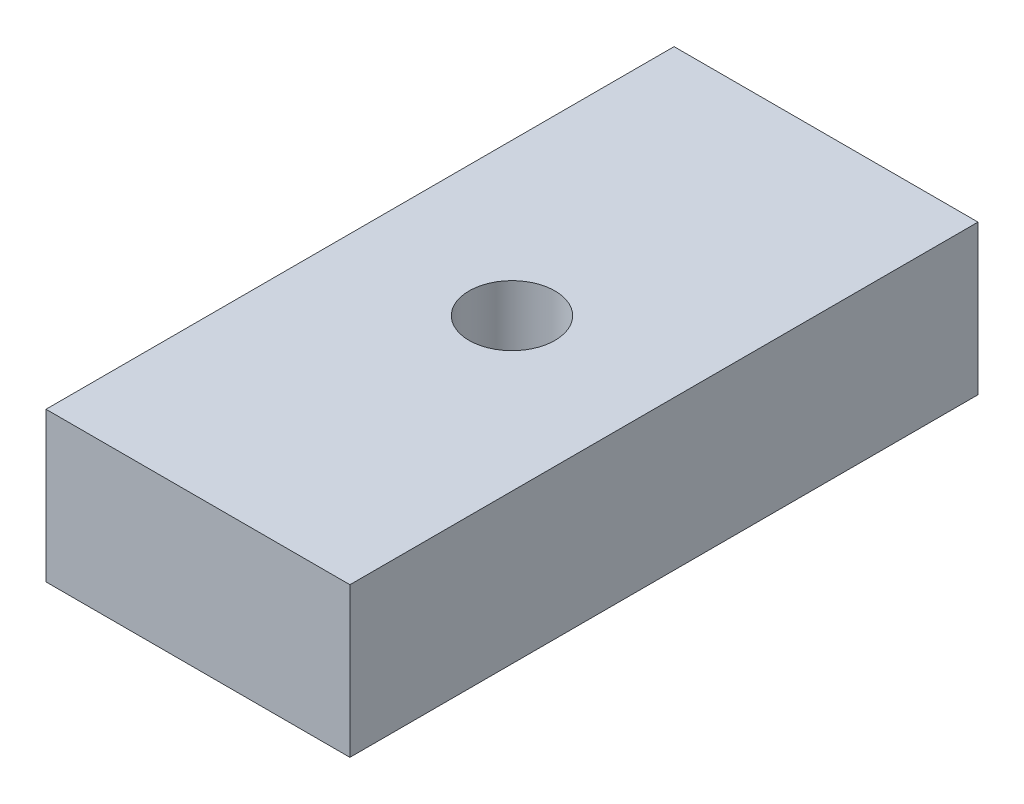
ISO-10303-21;
HEADER;
FILE_DESCRIPTION(('STEP AP214'),'2;1');
FILE_NAME('part.step','',(''),(''),'','','');
FILE_SCHEMA(('AUTOMOTIVE_DESIGN { 1 0 10303 214 1 1 1 1 }'));
ENDSEC;
DATA;
#1=APPLICATION_CONTEXT('core data for automotive mechanical design processes');
#2=APPLICATION_PROTOCOL_DEFINITION('international standard','automotive_design',2000,#1);
#3=PRODUCT_CONTEXT('',#1,'mechanical');
#4=PRODUCT('Part','Part','',(#3));
#5=PRODUCT_RELATED_PRODUCT_CATEGORY('part','',(#4));
#6=PRODUCT_DEFINITION_FORMATION('','',#4);
#7=PRODUCT_DEFINITION_CONTEXT('part definition',#1,'design');
#8=PRODUCT_DEFINITION('design','',#6,#7);
#9=PRODUCT_DEFINITION_SHAPE('','',#8);
#10=(LENGTH_UNIT() NAMED_UNIT(*) SI_UNIT(.MILLI.,.METRE.));
#11=(NAMED_UNIT(*) PLANE_ANGLE_UNIT() SI_UNIT($,.RADIAN.));
#12=(NAMED_UNIT(*) SI_UNIT($,.STERADIAN.) SOLID_ANGLE_UNIT());
#13=UNCERTAINTY_MEASURE_WITH_UNIT(LENGTH_MEASURE(1.E-05),#10,'distance_accuracy_value','');
#14=(GEOMETRIC_REPRESENTATION_CONTEXT(3) GLOBAL_UNCERTAINTY_ASSIGNED_CONTEXT((#13)) GLOBAL_UNIT_ASSIGNED_CONTEXT((#10,
#11,#12)) REPRESENTATION_CONTEXT('',''));
#15=CARTESIAN_POINT('',(0.,0.,0.));
#16=DIRECTION('',(0.,0.,1.));
#17=DIRECTION('',(1.,0.,0.));
#18=AXIS2_PLACEMENT_3D('',#15,#16,#17);
#19=CARTESIAN_POINT('',(4.0005,3.937,8.2677));
#20=DIRECTION('',(-1.,0.,0.));
#21=DIRECTION('',(0.,0.,1.));
#22=AXIS2_PLACEMENT_3D('',#19,#20,#21);
#23=PLANE('',#22);
#24=DIRECTION('',(0.,0.,-1.));
#25=VECTOR('',#24,1.);
#26=CARTESIAN_POINT('',(4.0005,0.,8.2677));
#27=LINE('',#26,#25);
#28=CARTESIAN_POINT('',(4.0005,0.,8.2677));
#29=VERTEX_POINT('',#28);
#30=CARTESIAN_POINT('',(4.0005,0.,-8.2677));
#31=VERTEX_POINT('',#30);
#32=EDGE_CURVE('E105',#29,#31,#27,.T.);
#33=ORIENTED_EDGE('',*,*,#32,.T.);
#34=DIRECTION('',(0.,-1.,0.));
#35=VECTOR('',#34,1.);
#36=CARTESIAN_POINT('',(4.0005,3.937,-8.2677));
#37=LINE('',#36,#35);
#38=CARTESIAN_POINT('',(4.0005,3.937,-8.2677));
#39=VERTEX_POINT('',#38);
#40=EDGE_CURVE('E11',#39,#31,#37,.T.);
#41=ORIENTED_EDGE('',*,*,#40,.F.);
#42=DIRECTION('',(0.,0.,-1.));
#43=VECTOR('',#42,1.);
#44=CARTESIAN_POINT('',(4.0005,3.937,8.2677));
#45=LINE('',#44,#43);
#46=CARTESIAN_POINT('',(4.0005,3.937,8.2677));
#47=VERTEX_POINT('',#46);
#48=EDGE_CURVE('E93',#47,#39,#45,.T.);
#49=ORIENTED_EDGE('',*,*,#48,.F.);
#50=DIRECTION('',(0.,-1.,0.));
#51=VECTOR('',#50,1.);
#52=CARTESIAN_POINT('',(4.0005,3.937,8.2677));
#53=LINE('',#52,#51);
#54=EDGE_CURVE('E101',#47,#29,#53,.T.);
#55=ORIENTED_EDGE('',*,*,#54,.T.);
#56=EDGE_LOOP('',(#33,#41,#49,#55));
#57=FACE_BOUND('',#56,.T.);
#58=ADVANCED_FACE('F42',(#57),#23,.F.);
#59=CARTESIAN_POINT('',(-4.0005,3.937,-8.2677));
#60=DIRECTION('',(0.,0.,1.));
#61=DIRECTION('',(1.,0.,0.));
#62=AXIS2_PLACEMENT_3D('',#59,#60,#61);
#63=PLANE('',#62);
#64=DIRECTION('',(-1.,0.,0.));
#65=VECTOR('',#64,1.);
#66=CARTESIAN_POINT('',(-4.0005,0.,-8.2677));
#67=LINE('',#66,#65);
#68=CARTESIAN_POINT('',(-4.0005,0.,-8.2677));
#69=VERTEX_POINT('',#68);
#70=EDGE_CURVE('E97',#31,#69,#67,.T.);
#71=ORIENTED_EDGE('',*,*,#70,.T.);
#72=DIRECTION('',(0.,-1.,0.));
#73=VECTOR('',#72,1.);
#74=CARTESIAN_POINT('',(-4.0005,3.937,-8.2677));
#75=LINE('',#74,#73);
#76=CARTESIAN_POINT('',(-4.0005,3.937,-8.2677));
#77=VERTEX_POINT('',#76);
#78=EDGE_CURVE('E50',#77,#69,#75,.T.);
#79=ORIENTED_EDGE('',*,*,#78,.F.);
#80=DIRECTION('',(-1.,0.,0.));
#81=VECTOR('',#80,1.);
#82=CARTESIAN_POINT('',(-4.0005,3.937,-8.2677));
#83=LINE('',#82,#81);
#84=EDGE_CURVE('E88',#39,#77,#83,.T.);
#85=ORIENTED_EDGE('',*,*,#84,.F.);
#86=ORIENTED_EDGE('',*,*,#40,.T.);
#87=EDGE_LOOP('',(#71,#79,#85,#86));
#88=FACE_BOUND('',#87,.T.);
#89=ADVANCED_FACE('F96',(#88),#63,.F.);
#90=CARTESIAN_POINT('',(-4.0005,3.937,8.2677));
#91=DIRECTION('',(1.,0.,0.));
#92=DIRECTION('',(0.,0.,-1.));
#93=AXIS2_PLACEMENT_3D('',#90,#91,#92);
#94=PLANE('',#93);
#95=DIRECTION('',(0.,0.,1.));
#96=VECTOR('',#95,1.);
#97=CARTESIAN_POINT('',(-4.0005,0.,8.2677));
#98=LINE('',#97,#96);
#99=CARTESIAN_POINT('',(-4.0005,0.,8.2677));
#100=VERTEX_POINT('',#99);
#101=EDGE_CURVE('E75',#69,#100,#98,.T.);
#102=ORIENTED_EDGE('',*,*,#101,.T.);
#103=DIRECTION('',(0.,-1.,0.));
#104=VECTOR('',#103,1.);
#105=CARTESIAN_POINT('',(-4.0005,3.937,8.2677));
#106=LINE('',#105,#104);
#107=CARTESIAN_POINT('',(-4.0005,3.937,8.2677));
#108=VERTEX_POINT('',#107);
#109=EDGE_CURVE('E98',#108,#100,#106,.T.);
#110=ORIENTED_EDGE('',*,*,#109,.F.);
#111=DIRECTION('',(0.,0.,1.));
#112=VECTOR('',#111,1.);
#113=CARTESIAN_POINT('',(-4.0005,3.937,8.2677));
#114=LINE('',#113,#112);
#115=EDGE_CURVE('E91',#77,#108,#114,.T.);
#116=ORIENTED_EDGE('',*,*,#115,.F.);
#117=ORIENTED_EDGE('',*,*,#78,.T.);
#118=EDGE_LOOP('',(#102,#110,#116,#117));
#119=FACE_BOUND('',#118,.T.);
#120=ADVANCED_FACE('F99',(#119),#94,.F.);
#121=CARTESIAN_POINT('',(-4.0005,3.937,8.2677));
#122=DIRECTION('',(0.,0.,-1.));
#123=DIRECTION('',(-1.,0.,0.));
#124=AXIS2_PLACEMENT_3D('',#121,#122,#123);
#125=PLANE('',#124);
#126=DIRECTION('',(1.,0.,0.));
#127=VECTOR('',#126,1.);
#128=CARTESIAN_POINT('',(-4.0005,0.,8.2677));
#129=LINE('',#128,#127);
#130=EDGE_CURVE('E81',#100,#29,#129,.T.);
#131=ORIENTED_EDGE('',*,*,#130,.T.);
#132=ORIENTED_EDGE('',*,*,#54,.F.);
#133=DIRECTION('',(1.,0.,0.));
#134=VECTOR('',#133,1.);
#135=CARTESIAN_POINT('',(-4.0005,3.937,8.2677));
#136=LINE('',#135,#134);
#137=EDGE_CURVE('E58',#108,#47,#136,.T.);
#138=ORIENTED_EDGE('',*,*,#137,.F.);
#139=ORIENTED_EDGE('',*,*,#109,.T.);
#140=EDGE_LOOP('',(#131,#132,#138,#139));
#141=FACE_BOUND('',#140,.T.);
#142=ADVANCED_FACE('F113',(#141),#125,.F.);
#143=CARTESIAN_POINT('',(0.,3.937,0.));
#144=DIRECTION('',(0.,-1.,0.));
#145=DIRECTION('',(0.,0.,-1.));
#146=AXIS2_PLACEMENT_3D('',#143,#144,#145);
#147=PLANE('',#146);
#148=CARTESIAN_POINT('',(0.,3.937,0.));
#149=DIRECTION('',(0.,1.,0.));
#150=DIRECTION('',(0.,0.,1.));
#151=AXIS2_PLACEMENT_3D('',#148,#149,#150);
#152=CIRCLE('',#151,1.13029999999999);
#153=CARTESIAN_POINT('',(0.,3.937,1.13029999999999));
#154=VERTEX_POINT('',#153);
#155=EDGE_CURVE('E121',#154,#154,#152,.T.);
#156=ORIENTED_EDGE('',*,*,#155,.F.);
#157=EDGE_LOOP('',(#156));
#158=FACE_BOUND('',#157,.T.);
#159=ORIENTED_EDGE('',*,*,#48,.T.);
#160=ORIENTED_EDGE('',*,*,#84,.T.);
#161=ORIENTED_EDGE('',*,*,#115,.T.);
#162=ORIENTED_EDGE('',*,*,#137,.T.);
#163=EDGE_LOOP('',(#159,#160,#161,#162));
#164=FACE_BOUND('',#163,.T.);
#165=ADVANCED_FACE('F89',(#158,#164),#147,.F.);
#166=CARTESIAN_POINT('',(0.,0.,0.));
#167=DIRECTION('',(0.,-1.,0.));
#168=DIRECTION('',(0.,0.,-1.));
#169=AXIS2_PLACEMENT_3D('',#166,#167,#168);
#170=PLANE('',#169);
#171=CARTESIAN_POINT('',(0.,0.,0.));
#172=DIRECTION('',(0.,1.,0.));
#173=DIRECTION('',(0.,0.,1.));
#174=AXIS2_PLACEMENT_3D('',#171,#172,#173);
#175=CIRCLE('',#174,1.13029999999999);
#176=CARTESIAN_POINT('',(0.,0.,1.13029999999999));
#177=VERTEX_POINT('',#176);
#178=EDGE_CURVE('E108',#177,#177,#175,.T.);
#179=ORIENTED_EDGE('',*,*,#178,.T.);
#180=EDGE_LOOP('',(#179));
#181=FACE_BOUND('',#180,.T.);
#182=ORIENTED_EDGE('',*,*,#32,.F.);
#183=ORIENTED_EDGE('',*,*,#130,.F.);
#184=ORIENTED_EDGE('',*,*,#101,.F.);
#185=ORIENTED_EDGE('',*,*,#70,.F.);
#186=EDGE_LOOP('',(#182,#183,#184,#185));
#187=FACE_BOUND('',#186,.T.);
#188=ADVANCED_FACE('F116',(#181,#187),#170,.T.);
#189=CARTESIAN_POINT('',(0.,3.937,0.));
#190=DIRECTION('',(0.,1.,0.));
#191=DIRECTION('',(0.,0.,1.));
#192=AXIS2_PLACEMENT_3D('',#189,#190,#191);
#193=CYLINDRICAL_SURFACE('',#192,1.13029999999999);
#194=ORIENTED_EDGE('',*,*,#178,.F.);
#195=EDGE_LOOP('',(#194));
#196=FACE_BOUND('',#195,.T.);
#197=ORIENTED_EDGE('',*,*,#155,.T.);
#198=EDGE_LOOP('',(#197));
#199=FACE_BOUND('',#198,.T.);
#200=ADVANCED_FACE('F125',(#196,#199),#193,.F.);
#201=CLOSED_SHELL('',(#58,#89,#120,#142,#165,#188,#200));
#202=MANIFOLD_SOLID_BREP('B2',#201);
#203=ADVANCED_BREP_SHAPE_REPRESENTATION('',(#18,#202),#14);
#204=SHAPE_DEFINITION_REPRESENTATION(#9,#203);
ENDSEC;
END-ISO-10303-21;
